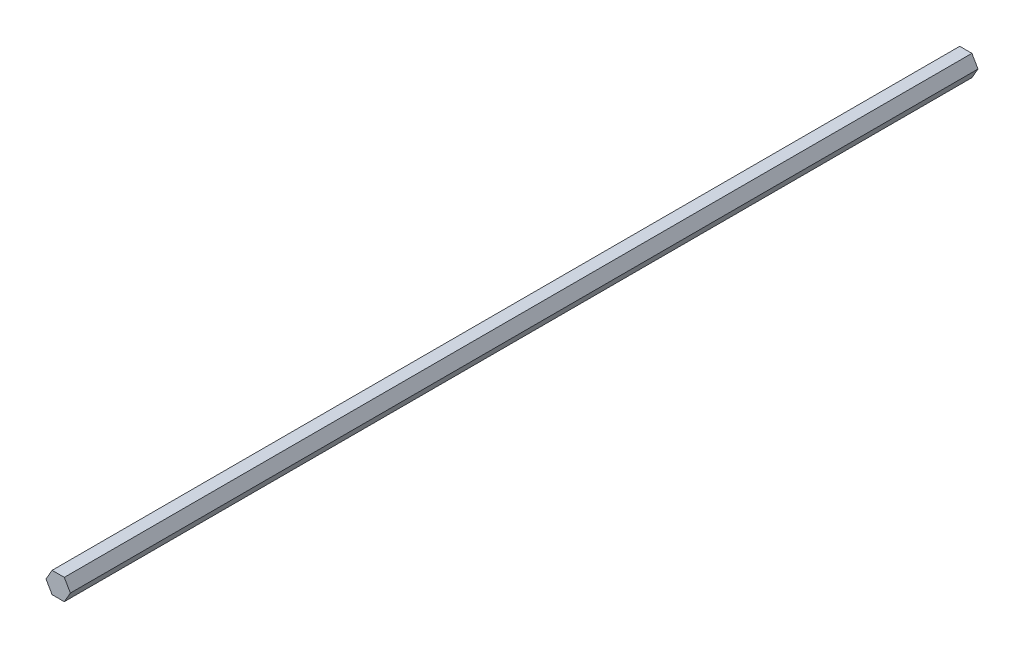
ISO-10303-21;
HEADER;
FILE_DESCRIPTION(('STEP AP214'),'2;1');
FILE_NAME('part.step','',(''),(''),'','','');
FILE_SCHEMA(('AUTOMOTIVE_DESIGN { 1 0 10303 214 1 1 1 1 }'));
ENDSEC;
DATA;
#1=APPLICATION_CONTEXT('core data for automotive mechanical design processes');
#2=APPLICATION_PROTOCOL_DEFINITION('international standard','automotive_design',2000,#1);
#3=PRODUCT_CONTEXT('',#1,'mechanical');
#4=PRODUCT('Part','Part','',(#3));
#5=PRODUCT_RELATED_PRODUCT_CATEGORY('part','',(#4));
#6=PRODUCT_DEFINITION_FORMATION('','',#4);
#7=PRODUCT_DEFINITION_CONTEXT('part definition',#1,'design');
#8=PRODUCT_DEFINITION('design','',#6,#7);
#9=PRODUCT_DEFINITION_SHAPE('','',#8);
#10=(LENGTH_UNIT() NAMED_UNIT(*) SI_UNIT(.MILLI.,.METRE.));
#11=(NAMED_UNIT(*) PLANE_ANGLE_UNIT() SI_UNIT($,.RADIAN.));
#12=(NAMED_UNIT(*) SI_UNIT($,.STERADIAN.) SOLID_ANGLE_UNIT());
#13=UNCERTAINTY_MEASURE_WITH_UNIT(LENGTH_MEASURE(1.E-05),#10,'distance_accuracy_value','');
#14=(GEOMETRIC_REPRESENTATION_CONTEXT(3) GLOBAL_UNCERTAINTY_ASSIGNED_CONTEXT((#13)) GLOBAL_UNIT_ASSIGNED_CONTEXT((#10,
#11,#12)) REPRESENTATION_CONTEXT('',''));
#15=CARTESIAN_POINT('',(0.,0.,0.));
#16=DIRECTION('',(0.,0.,1.));
#17=DIRECTION('',(1.,0.,0.));
#18=AXIS2_PLACEMENT_3D('',#15,#16,#17);
#19=CARTESIAN_POINT('',(3.6661742093542,-6.34999999999996,-38.1));
#20=DIRECTION('',(0.866025403784441,-0.499999999999995,0.));
#21=DIRECTION('',(0.499999999999995,0.866025403784441,0.));
#22=AXIS2_PLACEMENT_3D('',#19,#20,#21);
#23=PLANE('',#22);
#24=DIRECTION('',(0.,0.,1.));
#25=VECTOR('',#24,1.);
#26=CARTESIAN_POINT('',(7.33234841870826,0.,-38.1));
#27=LINE('',#26,#25);
#28=CARTESIAN_POINT('',(7.33234841870826,0.,-38.1));
#29=VERTEX_POINT('',#28);
#30=CARTESIAN_POINT('',(7.33234841870826,0.,508.));
#31=VERTEX_POINT('',#30);
#32=EDGE_CURVE('E42',#29,#31,#27,.T.);
#33=ORIENTED_EDGE('',*,*,#32,.T.);
#34=DIRECTION('',(0.499999999999995,0.866025403784441,0.));
#35=VECTOR('',#34,1.);
#36=CARTESIAN_POINT('',(3.6661742093542,-6.34999999999996,508.));
#37=LINE('',#36,#35);
#38=CARTESIAN_POINT('',(3.6661742093542,-6.34999999999996,508.));
#39=VERTEX_POINT('',#38);
#40=EDGE_CURVE('E92',#39,#31,#37,.T.);
#41=ORIENTED_EDGE('',*,*,#40,.F.);
#42=DIRECTION('',(0.,0.,1.));
#43=VECTOR('',#42,1.);
#44=CARTESIAN_POINT('',(3.6661742093542,-6.34999999999996,-38.1));
#45=LINE('',#44,#43);
#46=CARTESIAN_POINT('',(3.6661742093542,-6.34999999999996,-38.1));
#47=VERTEX_POINT('',#46);
#48=EDGE_CURVE('E11',#47,#39,#45,.T.);
#49=ORIENTED_EDGE('',*,*,#48,.F.);
#50=DIRECTION('',(0.499999999999995,0.866025403784441,0.));
#51=VECTOR('',#50,1.);
#52=CARTESIAN_POINT('',(3.6661742093542,-6.34999999999996,-38.1));
#53=LINE('',#52,#51);
#54=EDGE_CURVE('E93',#47,#29,#53,.T.);
#55=ORIENTED_EDGE('',*,*,#54,.T.);
#56=EDGE_LOOP('',(#33,#41,#49,#55));
#57=FACE_BOUND('',#56,.T.);
#58=ADVANCED_FACE('F39',(#57),#23,.T.);
#59=CARTESIAN_POINT('',(-3.66617420935407,-6.35000000000004,-38.1));
#60=DIRECTION('',(0.,-1.,0.));
#61=DIRECTION('',(1.,0.,0.));
#62=AXIS2_PLACEMENT_3D('',#59,#60,#61);
#63=PLANE('',#62);
#64=ORIENTED_EDGE('',*,*,#48,.T.);
#65=DIRECTION('',(1.,0.,0.));
#66=VECTOR('',#65,1.);
#67=CARTESIAN_POINT('',(-3.66617420935407,-6.35000000000004,508.));
#68=LINE('',#67,#66);
#69=CARTESIAN_POINT('',(-3.66617420935407,-6.35000000000004,508.));
#70=VERTEX_POINT('',#69);
#71=EDGE_CURVE('E112',#70,#39,#68,.T.);
#72=ORIENTED_EDGE('',*,*,#71,.F.);
#73=DIRECTION('',(0.,0.,1.));
#74=VECTOR('',#73,1.);
#75=CARTESIAN_POINT('',(-3.66617420935407,-6.35000000000004,-38.1));
#76=LINE('',#75,#74);
#77=CARTESIAN_POINT('',(-3.66617420935407,-6.35000000000004,-38.1));
#78=VERTEX_POINT('',#77);
#79=EDGE_CURVE('E48',#78,#70,#76,.T.);
#80=ORIENTED_EDGE('',*,*,#79,.F.);
#81=DIRECTION('',(1.,0.,0.));
#82=VECTOR('',#81,1.);
#83=CARTESIAN_POINT('',(-3.66617420935407,-6.35000000000004,-38.1));
#84=LINE('',#83,#82);
#85=EDGE_CURVE('E99',#78,#47,#84,.T.);
#86=ORIENTED_EDGE('',*,*,#85,.T.);
#87=EDGE_LOOP('',(#64,#72,#80,#86));
#88=FACE_BOUND('',#87,.T.);
#89=ADVANCED_FACE('F167',(#88),#63,.T.);
#90=CARTESIAN_POINT('',(-7.33234841870825,0.,-38.1));
#91=DIRECTION('',(-0.866025403784435,-0.500000000000007,0.));
#92=DIRECTION('',(0.500000000000007,-0.866025403784434,0.));
#93=AXIS2_PLACEMENT_3D('',#90,#91,#92);
#94=PLANE('',#93);
#95=ORIENTED_EDGE('',*,*,#79,.T.);
#96=DIRECTION('',(0.500000000000007,-0.866025403784434,0.));
#97=VECTOR('',#96,1.);
#98=CARTESIAN_POINT('',(-7.33234841870825,0.,508.));
#99=LINE('',#98,#97);
#100=CARTESIAN_POINT('',(-7.33234841870825,0.,508.));
#101=VERTEX_POINT('',#100);
#102=EDGE_CURVE('E122',#101,#70,#99,.T.);
#103=ORIENTED_EDGE('',*,*,#102,.F.);
#104=DIRECTION('',(0.,0.,1.));
#105=VECTOR('',#104,1.);
#106=CARTESIAN_POINT('',(-7.33234841870825,0.,-38.1));
#107=LINE('',#106,#105);
#108=CARTESIAN_POINT('',(-7.33234841870825,0.,-38.1));
#109=VERTEX_POINT('',#108);
#110=EDGE_CURVE('E147',#109,#101,#107,.T.);
#111=ORIENTED_EDGE('',*,*,#110,.F.);
#112=DIRECTION('',(0.500000000000007,-0.866025403784434,0.));
#113=VECTOR('',#112,1.);
#114=CARTESIAN_POINT('',(-7.33234841870825,0.,-38.1));
#115=LINE('',#114,#113);
#116=EDGE_CURVE('E140',#109,#78,#115,.T.);
#117=ORIENTED_EDGE('',*,*,#116,.T.);
#118=EDGE_LOOP('',(#95,#103,#111,#117));
#119=FACE_BOUND('',#118,.T.);
#120=ADVANCED_FACE('F163',(#119),#94,.T.);
#121=CARTESIAN_POINT('',(-3.66617420935416,6.34999999999999,-38.1));
#122=DIRECTION('',(-0.866025403784442,0.499999999999995,0.));
#123=DIRECTION('',(-0.499999999999995,-0.866025403784442,0.));
#124=AXIS2_PLACEMENT_3D('',#121,#122,#123);
#125=PLANE('',#124);
#126=ORIENTED_EDGE('',*,*,#110,.T.);
#127=DIRECTION('',(-0.499999999999995,-0.866025403784442,0.));
#128=VECTOR('',#127,1.);
#129=CARTESIAN_POINT('',(-3.66617420935416,6.34999999999999,508.));
#130=LINE('',#129,#128);
#131=CARTESIAN_POINT('',(-3.66617420935416,6.34999999999999,508.));
#132=VERTEX_POINT('',#131);
#133=EDGE_CURVE('E118',#132,#101,#130,.T.);
#134=ORIENTED_EDGE('',*,*,#133,.F.);
#135=DIRECTION('',(0.,0.,1.));
#136=VECTOR('',#135,1.);
#137=CARTESIAN_POINT('',(-3.66617420935416,6.34999999999999,-38.1));
#138=LINE('',#137,#136);
#139=CARTESIAN_POINT('',(-3.66617420935416,6.34999999999999,-38.1));
#140=VERTEX_POINT('',#139);
#141=EDGE_CURVE('E150',#140,#132,#138,.T.);
#142=ORIENTED_EDGE('',*,*,#141,.F.);
#143=DIRECTION('',(-0.499999999999995,-0.866025403784442,0.));
#144=VECTOR('',#143,1.);
#145=CARTESIAN_POINT('',(-3.66617420935416,6.34999999999999,-38.1));
#146=LINE('',#145,#144);
#147=EDGE_CURVE('E136',#140,#109,#146,.T.);
#148=ORIENTED_EDGE('',*,*,#147,.T.);
#149=EDGE_LOOP('',(#126,#134,#142,#148));
#150=FACE_BOUND('',#149,.T.);
#151=ADVANCED_FACE('F160',(#150),#125,.T.);
#152=CARTESIAN_POINT('',(3.66617420935411,6.35000000000001,-38.1));
#153=DIRECTION('',(0.,1.,0.));
#154=DIRECTION('',(-1.,0.,0.));
#155=AXIS2_PLACEMENT_3D('',#152,#153,#154);
#156=PLANE('',#155);
#157=ORIENTED_EDGE('',*,*,#141,.T.);
#158=DIRECTION('',(-1.,0.,0.));
#159=VECTOR('',#158,1.);
#160=CARTESIAN_POINT('',(3.66617420935411,6.35000000000001,508.));
#161=LINE('',#160,#159);
#162=CARTESIAN_POINT('',(3.66617420935411,6.35000000000001,508.));
#163=VERTEX_POINT('',#162);
#164=EDGE_CURVE('E107',#163,#132,#161,.T.);
#165=ORIENTED_EDGE('',*,*,#164,.F.);
#166=DIRECTION('',(0.,0.,1.));
#167=VECTOR('',#166,1.);
#168=CARTESIAN_POINT('',(3.66617420935411,6.35000000000001,-38.1));
#169=LINE('',#168,#167);
#170=CARTESIAN_POINT('',(3.66617420935411,6.35000000000001,-38.1));
#171=VERTEX_POINT('',#170);
#172=EDGE_CURVE('E98',#171,#163,#169,.T.);
#173=ORIENTED_EDGE('',*,*,#172,.F.);
#174=DIRECTION('',(-1.,0.,0.));
#175=VECTOR('',#174,1.);
#176=CARTESIAN_POINT('',(3.66617420935411,6.35000000000001,-38.1));
#177=LINE('',#176,#175);
#178=EDGE_CURVE('E132',#171,#140,#177,.T.);
#179=ORIENTED_EDGE('',*,*,#178,.T.);
#180=EDGE_LOOP('',(#157,#165,#173,#179));
#181=FACE_BOUND('',#180,.T.);
#182=ADVANCED_FACE('F154',(#181),#156,.T.);
#183=CARTESIAN_POINT('',(7.33234841870826,0.,-38.1));
#184=DIRECTION('',(0.866025403784438,0.500000000000001,0.));
#185=DIRECTION('',(-0.500000000000001,0.866025403784438,0.));
#186=AXIS2_PLACEMENT_3D('',#183,#184,#185);
#187=PLANE('',#186);
#188=ORIENTED_EDGE('',*,*,#172,.T.);
#189=DIRECTION('',(-0.500000000000001,0.866025403784438,0.));
#190=VECTOR('',#189,1.);
#191=CARTESIAN_POINT('',(7.33234841870826,0.,508.));
#192=LINE('',#191,#190);
#193=EDGE_CURVE('E101',#31,#163,#192,.T.);
#194=ORIENTED_EDGE('',*,*,#193,.F.);
#195=ORIENTED_EDGE('',*,*,#32,.F.);
#196=DIRECTION('',(-0.500000000000001,0.866025403784438,0.));
#197=VECTOR('',#196,1.);
#198=CARTESIAN_POINT('',(7.33234841870826,0.,-38.1));
#199=LINE('',#198,#197);
#200=EDGE_CURVE('E129',#29,#171,#199,.T.);
#201=ORIENTED_EDGE('',*,*,#200,.T.);
#202=EDGE_LOOP('',(#188,#194,#195,#201));
#203=FACE_BOUND('',#202,.T.);
#204=ADVANCED_FACE('F102',(#203),#187,.T.);
#205=CARTESIAN_POINT('',(0.,0.,-38.1));
#206=DIRECTION('',(0.,0.,1.));
#207=DIRECTION('',(1.,0.,0.));
#208=AXIS2_PLACEMENT_3D('',#205,#206,#207);
#209=PLANE('',#208);
#210=ORIENTED_EDGE('',*,*,#54,.F.);
#211=ORIENTED_EDGE('',*,*,#85,.F.);
#212=ORIENTED_EDGE('',*,*,#116,.F.);
#213=ORIENTED_EDGE('',*,*,#147,.F.);
#214=ORIENTED_EDGE('',*,*,#178,.F.);
#215=ORIENTED_EDGE('',*,*,#200,.F.);
#216=EDGE_LOOP('',(#210,#211,#212,#213,#214,#215));
#217=FACE_BOUND('',#216,.T.);
#218=ADVANCED_FACE('F166',(#217),#209,.F.);
#219=CARTESIAN_POINT('',(0.,0.,508.));
#220=DIRECTION('',(0.,0.,1.));
#221=DIRECTION('',(1.,0.,0.));
#222=AXIS2_PLACEMENT_3D('',#219,#220,#221);
#223=PLANE('',#222);
#224=ORIENTED_EDGE('',*,*,#40,.T.);
#225=ORIENTED_EDGE('',*,*,#193,.T.);
#226=ORIENTED_EDGE('',*,*,#164,.T.);
#227=ORIENTED_EDGE('',*,*,#133,.T.);
#228=ORIENTED_EDGE('',*,*,#102,.T.);
#229=ORIENTED_EDGE('',*,*,#71,.T.);
#230=EDGE_LOOP('',(#224,#225,#226,#227,#228,#229));
#231=FACE_BOUND('',#230,.T.);
#232=ADVANCED_FACE('F110',(#231),#223,.T.);
#233=CLOSED_SHELL('',(#58,#89,#120,#151,#182,#204,#218,#232));
#234=MANIFOLD_SOLID_BREP('B2',#233);
#235=ADVANCED_BREP_SHAPE_REPRESENTATION('',(#18,#234),#14);
#236=SHAPE_DEFINITION_REPRESENTATION(#9,#235);
ENDSEC;
END-ISO-10303-21;
